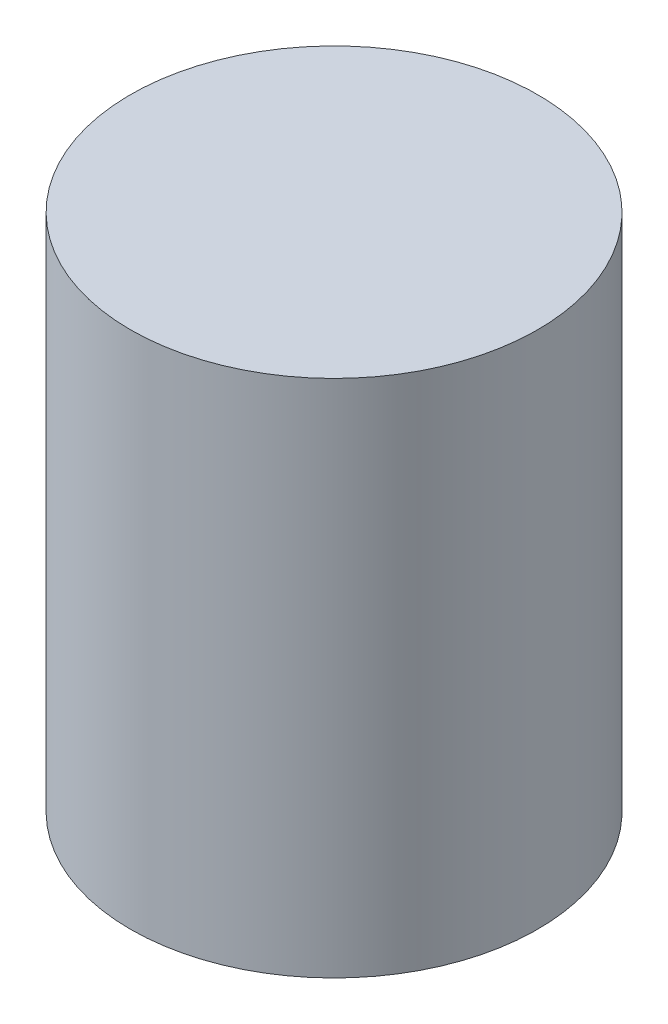
ISO-10303-21;
HEADER;
FILE_DESCRIPTION(('STEP AP214'),'2;1');
FILE_NAME('part.step','',(''),(''),'','','');
FILE_SCHEMA(('AUTOMOTIVE_DESIGN { 1 0 10303 214 1 1 1 1 }'));
ENDSEC;
DATA;
#1=APPLICATION_CONTEXT('core data for automotive mechanical design processes');
#2=APPLICATION_PROTOCOL_DEFINITION('international standard','automotive_design',2000,#1);
#3=PRODUCT_CONTEXT('',#1,'mechanical');
#4=PRODUCT('Part','Part','',(#3));
#5=PRODUCT_RELATED_PRODUCT_CATEGORY('part','',(#4));
#6=PRODUCT_DEFINITION_FORMATION('','',#4);
#7=PRODUCT_DEFINITION_CONTEXT('part definition',#1,'design');
#8=PRODUCT_DEFINITION('design','',#6,#7);
#9=PRODUCT_DEFINITION_SHAPE('','',#8);
#10=(LENGTH_UNIT() NAMED_UNIT(*) SI_UNIT(.MILLI.,.METRE.));
#11=(NAMED_UNIT(*) PLANE_ANGLE_UNIT() SI_UNIT($,.RADIAN.));
#12=(NAMED_UNIT(*) SI_UNIT($,.STERADIAN.) SOLID_ANGLE_UNIT());
#13=UNCERTAINTY_MEASURE_WITH_UNIT(LENGTH_MEASURE(1.E-05),#10,'distance_accuracy_value','');
#14=(GEOMETRIC_REPRESENTATION_CONTEXT(3) GLOBAL_UNCERTAINTY_ASSIGNED_CONTEXT((#13)) GLOBAL_UNIT_ASSIGNED_CONTEXT((#10,
#11,#12)) REPRESENTATION_CONTEXT('',''));
#15=CARTESIAN_POINT('',(0.,0.,0.));
#16=DIRECTION('',(0.,0.,1.));
#17=DIRECTION('',(1.,0.,0.));
#18=AXIS2_PLACEMENT_3D('',#15,#16,#17);
#19=CARTESIAN_POINT('',(-22.7705767790262,28.05,-24.3231161048689));
#20=DIRECTION('',(0.,-1.,0.));
#21=DIRECTION('',(0.,0.,-1.));
#22=AXIS2_PLACEMENT_3D('',#19,#20,#21);
#23=CYLINDRICAL_SURFACE('',#22,11.);
#24=CARTESIAN_POINT('',(-22.7705767790262,28.05,-24.3231161048689));
#25=DIRECTION('',(0.,1.,0.));
#26=DIRECTION('',(0.,0.,1.));
#27=AXIS2_PLACEMENT_3D('',#24,#25,#26);
#28=CIRCLE('',#27,11.);
#29=CARTESIAN_POINT('',(-22.7705767790262,28.05,-13.3231161048689));
#30=VERTEX_POINT('',#29);
#31=EDGE_CURVE('E10',#30,#30,#28,.T.);
#32=ORIENTED_EDGE('',*,*,#31,.F.);
#33=EDGE_LOOP('',(#32));
#34=FACE_BOUND('',#33,.T.);
#35=CARTESIAN_POINT('',(-22.7705767790262,0.,-24.3231161048689));
#36=DIRECTION('',(0.,1.,0.));
#37=DIRECTION('',(0.,0.,1.));
#38=AXIS2_PLACEMENT_3D('',#35,#36,#37);
#39=CIRCLE('',#38,11.);
#40=CARTESIAN_POINT('',(-22.7705767790262,0.,-13.3231161048689));
#41=VERTEX_POINT('',#40);
#42=EDGE_CURVE('E42',#41,#41,#39,.T.);
#43=ORIENTED_EDGE('',*,*,#42,.T.);
#44=EDGE_LOOP('',(#43));
#45=FACE_BOUND('',#44,.T.);
#46=ADVANCED_FACE('F39',(#34,#45),#23,.T.);
#47=CARTESIAN_POINT('',(-22.7705767790262,28.05,-24.3231161048689));
#48=DIRECTION('',(0.,1.,0.));
#49=DIRECTION('',(0.,0.,1.));
#50=AXIS2_PLACEMENT_3D('',#47,#48,#49);
#51=PLANE('',#50);
#52=ORIENTED_EDGE('',*,*,#31,.T.);
#53=EDGE_LOOP('',(#52));
#54=FACE_BOUND('',#53,.T.);
#55=ADVANCED_FACE('F54',(#54),#51,.T.);
#56=CARTESIAN_POINT('',(-22.7705767790262,0.,-24.3231161048689));
#57=DIRECTION('',(0.,1.,0.));
#58=DIRECTION('',(0.,0.,1.));
#59=AXIS2_PLACEMENT_3D('',#56,#57,#58);
#60=PLANE('',#59);
#61=ORIENTED_EDGE('',*,*,#42,.F.);
#62=EDGE_LOOP('',(#61));
#63=FACE_BOUND('',#62,.T.);
#64=ADVANCED_FACE('F52',(#63),#60,.F.);
#65=CLOSED_SHELL('',(#46,#55,#64));
#66=MANIFOLD_SOLID_BREP('B2',#65);
#67=ADVANCED_BREP_SHAPE_REPRESENTATION('',(#18,#66),#14);
#68=SHAPE_DEFINITION_REPRESENTATION(#9,#67);
ENDSEC;
END-ISO-10303-21;
